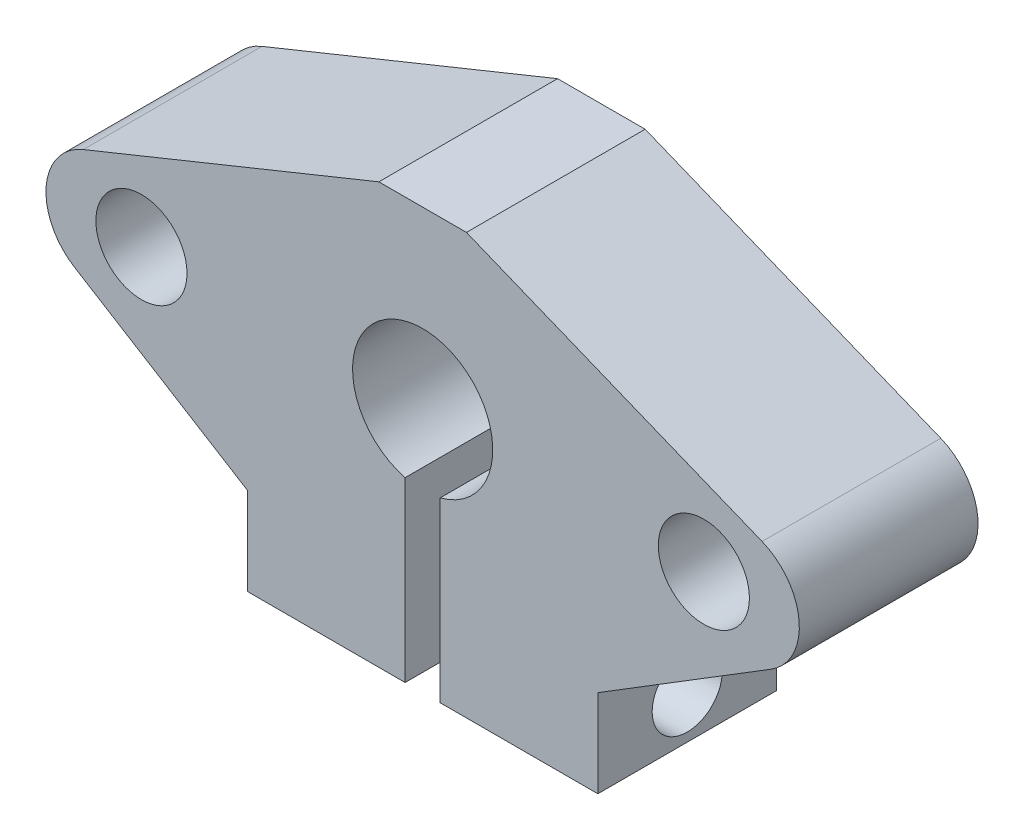
ISO-10303-21;
HEADER;
FILE_DESCRIPTION(('STEP AP214'),'2;1');
FILE_NAME('part.step','',(''),(''),'','','');
FILE_SCHEMA(('AUTOMOTIVE_DESIGN { 1 0 10303 214 1 1 1 1 }'));
ENDSEC;
DATA;
#1=APPLICATION_CONTEXT('core data for automotive mechanical design processes');
#2=APPLICATION_PROTOCOL_DEFINITION('international standard','automotive_design',2000,#1);
#3=PRODUCT_CONTEXT('',#1,'mechanical');
#4=PRODUCT('Part','Part','',(#3));
#5=PRODUCT_RELATED_PRODUCT_CATEGORY('part','',(#4));
#6=PRODUCT_DEFINITION_FORMATION('','',#4);
#7=PRODUCT_DEFINITION_CONTEXT('part definition',#1,'design');
#8=PRODUCT_DEFINITION('design','',#6,#7);
#9=PRODUCT_DEFINITION_SHAPE('','',#8);
#10=(LENGTH_UNIT() NAMED_UNIT(*) SI_UNIT(.MILLI.,.METRE.));
#11=(NAMED_UNIT(*) PLANE_ANGLE_UNIT() SI_UNIT($,.RADIAN.));
#12=(NAMED_UNIT(*) SI_UNIT($,.STERADIAN.) SOLID_ANGLE_UNIT());
#13=UNCERTAINTY_MEASURE_WITH_UNIT(LENGTH_MEASURE(1.E-05),#10,'distance_accuracy_value','');
#14=(GEOMETRIC_REPRESENTATION_CONTEXT(3) GLOBAL_UNCERTAINTY_ASSIGNED_CONTEXT((#13)) GLOBAL_UNIT_ASSIGNED_CONTEXT((#10,
#11,#12)) REPRESENTATION_CONTEXT('',''));
#15=CARTESIAN_POINT('',(0.,0.,0.));
#16=DIRECTION('',(0.,0.,1.));
#17=DIRECTION('',(1.,0.,0.));
#18=AXIS2_PLACEMENT_3D('',#15,#16,#17);
#19=CARTESIAN_POINT('',(-10.0000000000004,1.11022302462516E-13,10.1999999999997));
#20=DIRECTION('',(0.,1.,0.));
#21=DIRECTION('',(-1.,0.,0.));
#22=AXIS2_PLACEMENT_3D('',#19,#20,#21);
#23=PLANE('',#22);
#24=DIRECTION('',(1.,0.,0.));
#25=VECTOR('',#24,1.);
#26=CARTESIAN_POINT('',(-10.0000000000001,0.,0.));
#27=LINE('',#26,#25);
#28=CARTESIAN_POINT('',(-10.0000000000001,0.,0.));
#29=VERTEX_POINT('',#28);
#30=CARTESIAN_POINT('',(-0.999999999999834,0.,0.));
#31=VERTEX_POINT('',#30);
#32=EDGE_CURVE('E160',#29,#31,#27,.T.);
#33=ORIENTED_EDGE('',*,*,#32,.T.);
#34=DIRECTION('',(0.,0.,0.999999999999998));
#35=VECTOR('',#34,1.);
#36=CARTESIAN_POINT('',(-0.999999999999834,0.,0.));
#37=LINE('',#36,#35);
#38=CARTESIAN_POINT('',(-0.999999999999862,1.52655665885959E-13,10.1999999999998));
#39=VERTEX_POINT('',#38);
#40=EDGE_CURVE('E264',#31,#39,#37,.T.);
#41=ORIENTED_EDGE('',*,*,#40,.T.);
#42=DIRECTION('',(1.,0.,0.));
#43=VECTOR('',#42,1.);
#44=CARTESIAN_POINT('',(-10.0000000000004,1.11022302462516E-13,10.1999999999997));
#45=LINE('',#44,#43);
#46=CARTESIAN_POINT('',(-10.0000000000004,1.11022302462516E-13,10.1999999999997));
#47=VERTEX_POINT('',#46);
#48=EDGE_CURVE('E218',#47,#39,#45,.T.);
#49=ORIENTED_EDGE('',*,*,#48,.F.);
#50=DIRECTION('',(0.,0.,-0.999999999999998));
#51=VECTOR('',#50,1.);
#52=CARTESIAN_POINT('',(-10.0000000000004,1.11022302462516E-13,10.1999999999997));
#53=LINE('',#52,#51);
#54=EDGE_CURVE('E11',#47,#29,#53,.T.);
#55=ORIENTED_EDGE('',*,*,#54,.T.);
#56=EDGE_LOOP('',(#33,#41,#49,#55));
#57=FACE_BOUND('',#56,.T.);
#58=ADVANCED_FACE('F36',(#57),#23,.F.);
#59=CARTESIAN_POINT('',(18.0905948060089,14.,10.1999999999997));
#60=DIRECTION('',(0.,0.,0.999999999999998));
#61=DIRECTION('',(1.,0.,0.));
#62=AXIS2_PLACEMENT_3D('',#59,#60,#61);
#63=PLANE('',#62);
#64=DIRECTION('',(0.,-1.,0.));
#65=VECTOR('',#64,1.);
#66=CARTESIAN_POINT('',(-0.999999999999862,1.52655665885959E-13,10.1999999999998));
#67=LINE('',#66,#65);
#68=CARTESIAN_POINT('',(-1.00000000000014,10.1270166537927,10.1999999999998));
#69=VERTEX_POINT('',#68);
#70=EDGE_CURVE('E145',#69,#39,#67,.T.);
#71=ORIENTED_EDGE('',*,*,#70,.F.);
#72=CARTESIAN_POINT('',(0.,14.0000000000002,10.1999999999997));
#73=DIRECTION('',(0.,0.,0.999999999999998));
#74=DIRECTION('',(1.,0.,0.));
#75=AXIS2_PLACEMENT_3D('',#72,#73,#74);
#76=CIRCLE('',#75,4.);
#77=CARTESIAN_POINT('',(0.999999999999862,10.1270166537926,10.1999999999998));
#78=VERTEX_POINT('',#77);
#79=EDGE_CURVE('E165',#78,#69,#76,.T.);
#80=ORIENTED_EDGE('',*,*,#79,.F.);
#81=DIRECTION('',(0.,1.,0.));
#82=VECTOR('',#81,1.);
#83=CARTESIAN_POINT('',(0.999999999999862,0.,10.1999999999998));
#84=LINE('',#83,#82);
#85=CARTESIAN_POINT('',(0.999999999999862,0.,10.1999999999998));
#86=VERTEX_POINT('',#85);
#87=EDGE_CURVE('E60',#86,#78,#84,.T.);
#88=ORIENTED_EDGE('',*,*,#87,.F.);
#89=CARTESIAN_POINT('',(9.99999999999987,0.,10.1999999999997));
#90=VERTEX_POINT('',#89);
#91=EDGE_CURVE('E153',#86,#90,#45,.T.);
#92=ORIENTED_EDGE('',*,*,#91,.T.);
#93=DIRECTION('',(0.,1.,0.));
#94=VECTOR('',#93,1.);
#95=CARTESIAN_POINT('',(9.99999999999987,0.,10.1999999999997));
#96=LINE('',#95,#94);
#97=CARTESIAN_POINT('',(9.9999999999997,5.,10.1999999999997));
#98=VERTEX_POINT('',#97);
#99=EDGE_CURVE('E214',#90,#98,#96,.T.);
#100=ORIENTED_EDGE('',*,*,#99,.T.);
#101=DIRECTION('',(0.850968700396472,0.525216403918943,0.));
#102=VECTOR('',#101,1.);
#103=CARTESIAN_POINT('',(9.9999999999997,5.,10.1999999999997));
#104=LINE('',#103,#102);
#105=CARTESIAN_POINT('',(19.8812703414994,11.0987028929447,10.1999999999997));
#106=VERTEX_POINT('',#105);
#107=EDGE_CURVE('E217',#98,#106,#104,.T.);
#108=ORIENTED_EDGE('',*,*,#107,.T.);
#109=CARTESIAN_POINT('',(18.0905948060089,14.,10.1999999999997));
#110=DIRECTION('',(0.,0.,0.999999999999998));
#111=DIRECTION('',(1.,0.,0.));
#112=AXIS2_PLACEMENT_3D('',#109,#110,#111);
#113=CIRCLE('',#112,3.40940519399083);
#114=CARTESIAN_POINT('',(19.3716162404094,17.1595929898357,10.1999999999997));
#115=VERTEX_POINT('',#114);
#116=EDGE_CURVE('E220',#106,#115,#113,.T.);
#117=ORIENTED_EDGE('',*,*,#116,.T.);
#118=DIRECTION('',(-0.926728508364039,0.375731648634195,0.));
#119=VECTOR('',#118,1.);
#120=CARTESIAN_POINT('',(19.3716162404094,17.1595929898357,10.1999999999997));
#121=LINE('',#120,#119);
#122=CARTESIAN_POINT('',(2.5,24.,10.1999999999998));
#123=VERTEX_POINT('',#122);
#124=EDGE_CURVE('E227',#115,#123,#121,.T.);
#125=ORIENTED_EDGE('',*,*,#124,.T.);
#126=DIRECTION('',(-1.,0.,0.));
#127=VECTOR('',#126,1.);
#128=CARTESIAN_POINT('',(2.5,24.,10.1999999999998));
#129=LINE('',#128,#127);
#130=CARTESIAN_POINT('',(-2.50000000000014,24.,10.1999999999998));
#131=VERTEX_POINT('',#130);
#132=EDGE_CURVE('E229',#123,#131,#129,.T.);
#133=ORIENTED_EDGE('',*,*,#132,.T.);
#134=DIRECTION('',(-0.926728508364038,-0.375731648634195,0.));
#135=VECTOR('',#134,1.);
#136=CARTESIAN_POINT('',(-2.50000000000014,24.,10.1999999999998));
#137=LINE('',#136,#135);
#138=CARTESIAN_POINT('',(-19.3716162404095,17.1595929898357,10.1999999999998));
#139=VERTEX_POINT('',#138);
#140=EDGE_CURVE('E231',#131,#139,#137,.T.);
#141=ORIENTED_EDGE('',*,*,#140,.T.);
#142=CARTESIAN_POINT('',(-18.0905948060093,14.,10.1999999999997));
#143=DIRECTION('',(0.,0.,0.999999999999998));
#144=DIRECTION('',(1.,0.,0.));
#145=AXIS2_PLACEMENT_3D('',#142,#143,#144);
#146=CIRCLE('',#145,3.40940519399084);
#147=CARTESIAN_POINT('',(-19.8812703414997,11.0987028929447,10.1999999999998));
#148=VERTEX_POINT('',#147);
#149=EDGE_CURVE('E233',#139,#148,#146,.T.);
#150=ORIENTED_EDGE('',*,*,#149,.T.);
#151=DIRECTION('',(0.850968700396472,-0.525216403918942,0.));
#152=VECTOR('',#151,1.);
#153=CARTESIAN_POINT('',(-19.8812703414997,11.0987028929447,10.1999999999998));
#154=LINE('',#153,#152);
#155=CARTESIAN_POINT('',(-10.0000000000005,4.99999999999985,10.1999999999997));
#156=VERTEX_POINT('',#155);
#157=EDGE_CURVE('E189',#148,#156,#154,.T.);
#158=ORIENTED_EDGE('',*,*,#157,.T.);
#159=DIRECTION('',(0.,-1.,0.));
#160=VECTOR('',#159,1.);
#161=CARTESIAN_POINT('',(-10.0000000000005,4.99999999999985,10.1999999999997));
#162=LINE('',#161,#160);
#163=EDGE_CURVE('E184',#156,#47,#162,.T.);
#164=ORIENTED_EDGE('',*,*,#163,.T.);
#165=ORIENTED_EDGE('',*,*,#48,.T.);
#166=EDGE_LOOP('',(#71,#80,#88,#92,#100,#108,#117,#125,#133,#141,#150,#158,#164,#165));
#167=FACE_BOUND('',#166,.T.);
#168=CARTESIAN_POINT('',(16.05,14.,10.1999999999997));
#169=DIRECTION('',(0.,0.,0.999999999999998));
#170=DIRECTION('',(1.,0.,0.));
#171=AXIS2_PLACEMENT_3D('',#168,#169,#170);
#172=CIRCLE('',#171,2.6);
#173=CARTESIAN_POINT('',(18.65,14.,10.1999999999997));
#174=VERTEX_POINT('',#173);
#175=EDGE_CURVE('E252',#174,#174,#172,.T.);
#176=ORIENTED_EDGE('',*,*,#175,.F.);
#177=EDGE_LOOP('',(#176));
#178=FACE_BOUND('',#177,.T.);
#179=CARTESIAN_POINT('',(-16.0500000000003,14.,10.1999999999997));
#180=DIRECTION('',(0.,0.,0.999999999999998));
#181=DIRECTION('',(1.,0.,0.));
#182=AXIS2_PLACEMENT_3D('',#179,#180,#181);
#183=CIRCLE('',#182,2.6);
#184=CARTESIAN_POINT('',(-13.4500000000003,14.,10.1999999999997));
#185=VERTEX_POINT('',#184);
#186=EDGE_CURVE('E258',#185,#185,#183,.T.);
#187=ORIENTED_EDGE('',*,*,#186,.F.);
#188=EDGE_LOOP('',(#187));
#189=FACE_BOUND('',#188,.T.);
#190=ADVANCED_FACE('F238',(#167,#178,#189),#63,.T.);
#191=CARTESIAN_POINT('',(18.090594806009,14.,-3.05311331771918E-13));
#192=DIRECTION('',(0.,0.,0.999999999999998));
#193=DIRECTION('',(1.,0.,0.));
#194=AXIS2_PLACEMENT_3D('',#191,#192,#193);
#195=PLANE('',#194);
#196=CARTESIAN_POINT('',(0.,14.0000000000002,0.));
#197=DIRECTION('',(0.,0.,0.999999999999998));
#198=DIRECTION('',(1.,0.,0.));
#199=AXIS2_PLACEMENT_3D('',#196,#197,#198);
#200=CIRCLE('',#199,4.);
#201=CARTESIAN_POINT('',(1.00000000000017,10.1270166537926,0.));
#202=VERTEX_POINT('',#201);
#203=CARTESIAN_POINT('',(-0.999999999999834,10.1270166537927,0.));
#204=VERTEX_POINT('',#203);
#205=EDGE_CURVE('E250',#202,#204,#200,.T.);
#206=ORIENTED_EDGE('',*,*,#205,.T.);
#207=DIRECTION('',(0.,-1.,0.));
#208=VECTOR('',#207,1.);
#209=CARTESIAN_POINT('',(-0.999999999999834,0.,0.));
#210=LINE('',#209,#208);
#211=EDGE_CURVE('E52',#204,#31,#210,.T.);
#212=ORIENTED_EDGE('',*,*,#211,.T.);
#213=ORIENTED_EDGE('',*,*,#32,.F.);
#214=DIRECTION('',(0.,-1.,0.));
#215=VECTOR('',#214,1.);
#216=CARTESIAN_POINT('',(-10.0000000000001,4.99999999999999,0.));
#217=LINE('',#216,#215);
#218=CARTESIAN_POINT('',(-10.0000000000001,4.99999999999999,0.));
#219=VERTEX_POINT('',#218);
#220=EDGE_CURVE('E161',#219,#29,#217,.T.);
#221=ORIENTED_EDGE('',*,*,#220,.F.);
#222=DIRECTION('',(0.850968700396472,-0.525216403918942,0.));
#223=VECTOR('',#222,1.);
#224=CARTESIAN_POINT('',(-19.8812703414994,11.0987028929446,-3.05311331771918E-13));
#225=LINE('',#224,#223);
#226=CARTESIAN_POINT('',(-19.8812703414994,11.0987028929446,-3.05311331771918E-13));
#227=VERTEX_POINT('',#226);
#228=EDGE_CURVE('E182',#227,#219,#225,.T.);
#229=ORIENTED_EDGE('',*,*,#228,.F.);
#230=CARTESIAN_POINT('',(-18.090594806009,14.,-3.05311331771918E-13));
#231=DIRECTION('',(0.,0.,0.999999999999998));
#232=DIRECTION('',(1.,0.,0.));
#233=AXIS2_PLACEMENT_3D('',#230,#231,#232);
#234=CIRCLE('',#233,3.40940519399084);
#235=CARTESIAN_POINT('',(-19.3716162404093,17.1595929898356,-3.05311331771918E-13));
#236=VERTEX_POINT('',#235);
#237=EDGE_CURVE('E180',#236,#227,#234,.T.);
#238=ORIENTED_EDGE('',*,*,#237,.F.);
#239=DIRECTION('',(-0.926728508364038,-0.375731648634195,0.));
#240=VECTOR('',#239,1.);
#241=CARTESIAN_POINT('',(-2.49999999999984,24.,0.));
#242=LINE('',#241,#240);
#243=CARTESIAN_POINT('',(-2.49999999999984,24.,0.));
#244=VERTEX_POINT('',#243);
#245=EDGE_CURVE('E178',#244,#236,#242,.T.);
#246=ORIENTED_EDGE('',*,*,#245,.F.);
#247=DIRECTION('',(-1.,0.,0.));
#248=VECTOR('',#247,1.);
#249=CARTESIAN_POINT('',(2.50000000000028,24.,0.));
#250=LINE('',#249,#248);
#251=CARTESIAN_POINT('',(2.50000000000028,24.,0.));
#252=VERTEX_POINT('',#251);
#253=EDGE_CURVE('E176',#252,#244,#250,.T.);
#254=ORIENTED_EDGE('',*,*,#253,.F.);
#255=DIRECTION('',(-0.926728508364039,0.375731648634195,0.));
#256=VECTOR('',#255,1.);
#257=CARTESIAN_POINT('',(19.3716162404095,17.1595929898359,0.));
#258=LINE('',#257,#256);
#259=CARTESIAN_POINT('',(19.3716162404095,17.1595929898359,0.));
#260=VERTEX_POINT('',#259);
#261=EDGE_CURVE('E174',#260,#252,#258,.T.);
#262=ORIENTED_EDGE('',*,*,#261,.F.);
#263=CARTESIAN_POINT('',(18.090594806009,14.,-3.05311331771918E-13));
#264=DIRECTION('',(0.,0.,0.999999999999998));
#265=DIRECTION('',(1.,0.,0.));
#266=AXIS2_PLACEMENT_3D('',#263,#264,#265);
#267=CIRCLE('',#266,3.40940519399083);
#268=CARTESIAN_POINT('',(19.8812703414998,11.0987028929446,-3.05311331771918E-13));
#269=VERTEX_POINT('',#268);
#270=EDGE_CURVE('E172',#269,#260,#267,.T.);
#271=ORIENTED_EDGE('',*,*,#270,.F.);
#272=DIRECTION('',(0.850968700396472,0.525216403918943,0.));
#273=VECTOR('',#272,1.);
#274=CARTESIAN_POINT('',(10.,5.,0.));
#275=LINE('',#274,#273);
#276=CARTESIAN_POINT('',(10.,5.,0.));
#277=VERTEX_POINT('',#276);
#278=EDGE_CURVE('E170',#277,#269,#275,.T.);
#279=ORIENTED_EDGE('',*,*,#278,.F.);
#280=DIRECTION('',(0.,1.,0.));
#281=VECTOR('',#280,1.);
#282=CARTESIAN_POINT('',(10.0000000000001,-1.52655665885959E-13,0.));
#283=LINE('',#282,#281);
#284=CARTESIAN_POINT('',(10.0000000000001,-1.52655665885959E-13,0.));
#285=VERTEX_POINT('',#284);
#286=EDGE_CURVE('E159',#285,#277,#283,.T.);
#287=ORIENTED_EDGE('',*,*,#286,.F.);
#288=CARTESIAN_POINT('',(1.00000000000017,-1.52655665885959E-13,0.));
#289=VERTEX_POINT('',#288);
#290=EDGE_CURVE('E151',#289,#285,#27,.T.);
#291=ORIENTED_EDGE('',*,*,#290,.F.);
#292=DIRECTION('',(0.,1.,0.));
#293=VECTOR('',#292,1.);
#294=CARTESIAN_POINT('',(1.00000000000017,-1.52655665885959E-13,0.));
#295=LINE('',#294,#293);
#296=EDGE_CURVE('E136',#289,#202,#295,.T.);
#297=ORIENTED_EDGE('',*,*,#296,.T.);
#298=EDGE_LOOP('',(#206,#212,#213,#221,#229,#238,#246,#254,#262,#271,#279,#287,#291,#297));
#299=FACE_BOUND('',#298,.T.);
#300=CARTESIAN_POINT('',(16.05,14.,0.));
#301=DIRECTION('',(0.,0.,0.999999999999998));
#302=DIRECTION('',(1.,0.,0.));
#303=AXIS2_PLACEMENT_3D('',#300,#301,#302);
#304=CIRCLE('',#303,2.6);
#305=CARTESIAN_POINT('',(18.65,14.,0.));
#306=VERTEX_POINT('',#305);
#307=EDGE_CURVE('E255',#306,#306,#304,.T.);
#308=ORIENTED_EDGE('',*,*,#307,.T.);
#309=EDGE_LOOP('',(#308));
#310=FACE_BOUND('',#309,.T.);
#311=CARTESIAN_POINT('',(-16.05,14.,0.));
#312=DIRECTION('',(0.,0.,0.999999999999998));
#313=DIRECTION('',(1.,0.,0.));
#314=AXIS2_PLACEMENT_3D('',#311,#312,#313);
#315=CIRCLE('',#314,2.6);
#316=CARTESIAN_POINT('',(-13.45,14.,0.));
#317=VERTEX_POINT('',#316);
#318=EDGE_CURVE('E261',#317,#317,#315,.T.);
#319=ORIENTED_EDGE('',*,*,#318,.T.);
#320=EDGE_LOOP('',(#319));
#321=FACE_BOUND('',#320,.T.);
#322=ADVANCED_FACE('F156',(#299,#310,#321),#195,.F.);
#323=CARTESIAN_POINT('',(-10.0000000000005,4.99999999999985,10.1999999999997));
#324=DIRECTION('',(1.,0.,0.));
#325=DIRECTION('',(0.,1.,0.));
#326=AXIS2_PLACEMENT_3D('',#323,#324,#325);
#327=PLANE('',#326);
#328=CARTESIAN_POINT('',(-10.0000000000005,2.50000000000007,5.10000000000002));
#329=DIRECTION('',(1.,0.,0.));
#330=DIRECTION('',(0.,1.,0.));
#331=AXIS2_PLACEMENT_3D('',#328,#329,#330);
#332=CIRCLE('',#331,2.);
#333=CARTESIAN_POINT('',(-10.0000000000005,4.50000000000008,5.10000000000002));
#334=VERTEX_POINT('',#333);
#335=EDGE_CURVE('E274',#334,#334,#332,.T.);
#336=ORIENTED_EDGE('',*,*,#335,.T.);
#337=EDGE_LOOP('',(#336));
#338=FACE_BOUND('',#337,.T.);
#339=ORIENTED_EDGE('',*,*,#220,.T.);
#340=ORIENTED_EDGE('',*,*,#54,.F.);
#341=ORIENTED_EDGE('',*,*,#163,.F.);
#342=DIRECTION('',(0.,0.,-0.999999999999998));
#343=VECTOR('',#342,1.);
#344=CARTESIAN_POINT('',(-10.0000000000005,4.99999999999985,10.1999999999997));
#345=LINE('',#344,#343);
#346=EDGE_CURVE('E185',#156,#219,#345,.T.);
#347=ORIENTED_EDGE('',*,*,#346,.T.);
#348=EDGE_LOOP('',(#339,#340,#341,#347));
#349=FACE_BOUND('',#348,.T.);
#350=ADVANCED_FACE('F38',(#338,#349),#327,.F.);
#351=ORIENTED_EDGE('',*,*,#91,.F.);
#352=DIRECTION('',(0.,0.,0.999999999999998));
#353=VECTOR('',#352,1.);
#354=CARTESIAN_POINT('',(1.00000000000017,-1.52655665885959E-13,0.));
#355=LINE('',#354,#353);
#356=EDGE_CURVE('E139',#289,#86,#355,.T.);
#357=ORIENTED_EDGE('',*,*,#356,.F.);
#358=ORIENTED_EDGE('',*,*,#290,.T.);
#359=DIRECTION('',(0.,0.,-0.999999999999998));
#360=VECTOR('',#359,1.);
#361=CARTESIAN_POINT('',(9.99999999999987,0.,10.1999999999997));
#362=LINE('',#361,#360);
#363=EDGE_CURVE('E45',#90,#285,#362,.T.);
#364=ORIENTED_EDGE('',*,*,#363,.F.);
#365=EDGE_LOOP('',(#351,#357,#358,#364));
#366=FACE_BOUND('',#365,.T.);
#367=ADVANCED_FACE('F149',(#366),#23,.F.);
#368=CARTESIAN_POINT('',(9.99999999999987,0.,10.1999999999997));
#369=DIRECTION('',(-1.,0.,0.));
#370=DIRECTION('',(0.,0.,0.999999999999998));
#371=AXIS2_PLACEMENT_3D('',#368,#369,#370);
#372=PLANE('',#371);
#373=CARTESIAN_POINT('',(9.99999999999984,2.5,5.09999999999999));
#374=DIRECTION('',(-1.,0.,0.));
#375=DIRECTION('',(0.,0.,0.999999999999998));
#376=AXIS2_PLACEMENT_3D('',#373,#374,#375);
#377=CIRCLE('',#376,2.);
#378=CARTESIAN_POINT('',(9.99999999999984,2.5,7.09999999999999));
#379=VERTEX_POINT('',#378);
#380=EDGE_CURVE('E278',#379,#379,#377,.T.);
#381=ORIENTED_EDGE('',*,*,#380,.T.);
#382=EDGE_LOOP('',(#381));
#383=FACE_BOUND('',#382,.T.);
#384=ORIENTED_EDGE('',*,*,#286,.T.);
#385=DIRECTION('',(0.,0.,-0.999999999999998));
#386=VECTOR('',#385,1.);
#387=CARTESIAN_POINT('',(9.9999999999997,5.,10.1999999999997));
#388=LINE('',#387,#386);
#389=EDGE_CURVE('E207',#98,#277,#388,.T.);
#390=ORIENTED_EDGE('',*,*,#389,.F.);
#391=ORIENTED_EDGE('',*,*,#99,.F.);
#392=ORIENTED_EDGE('',*,*,#363,.T.);
#393=EDGE_LOOP('',(#384,#390,#391,#392));
#394=FACE_BOUND('',#393,.T.);
#395=ADVANCED_FACE('F212',(#383,#394),#372,.F.);
#396=CARTESIAN_POINT('',(9.9999999999997,5.,10.1999999999997));
#397=DIRECTION('',(-0.525216403918943,0.850968700396472,0.));
#398=DIRECTION('',(-0.850968700396472,-0.525216403918943,0.));
#399=AXIS2_PLACEMENT_3D('',#396,#397,#398);
#400=PLANE('',#399);
#401=ORIENTED_EDGE('',*,*,#278,.T.);
#402=DIRECTION('',(0.,0.,-0.999999999999998));
#403=VECTOR('',#402,1.);
#404=CARTESIAN_POINT('',(19.8812703414994,11.0987028929447,10.1999999999997));
#405=LINE('',#404,#403);
#406=EDGE_CURVE('E204',#106,#269,#405,.T.);
#407=ORIENTED_EDGE('',*,*,#406,.F.);
#408=ORIENTED_EDGE('',*,*,#107,.F.);
#409=ORIENTED_EDGE('',*,*,#389,.T.);
#410=EDGE_LOOP('',(#401,#407,#408,#409));
#411=FACE_BOUND('',#410,.T.);
#412=ADVANCED_FACE('F312',(#411),#400,.F.);
#413=CARTESIAN_POINT('',(18.0905948060089,14.,10.1999999999997));
#414=DIRECTION('',(0.,0.,-0.999999999999998));
#415=DIRECTION('',(-1.,0.,0.));
#416=AXIS2_PLACEMENT_3D('',#413,#414,#415);
#417=CYLINDRICAL_SURFACE('',#416,3.40940519399083);
#418=ORIENTED_EDGE('',*,*,#270,.T.);
#419=DIRECTION('',(0.,0.,-0.999999999999998));
#420=VECTOR('',#419,1.);
#421=CARTESIAN_POINT('',(19.3716162404094,17.1595929898357,10.1999999999997));
#422=LINE('',#421,#420);
#423=EDGE_CURVE('E201',#115,#260,#422,.T.);
#424=ORIENTED_EDGE('',*,*,#423,.F.);
#425=ORIENTED_EDGE('',*,*,#116,.F.);
#426=ORIENTED_EDGE('',*,*,#406,.T.);
#427=EDGE_LOOP('',(#418,#424,#425,#426));
#428=FACE_BOUND('',#427,.T.);
#429=ADVANCED_FACE('F316',(#428),#417,.T.);
#430=CARTESIAN_POINT('',(19.3716162404094,17.1595929898357,10.1999999999997));
#431=DIRECTION('',(-0.375731648634195,-0.926728508364039,0.));
#432=DIRECTION('',(0.926728508364039,-0.375731648634195,0.));
#433=AXIS2_PLACEMENT_3D('',#430,#431,#432);
#434=PLANE('',#433);
#435=ORIENTED_EDGE('',*,*,#261,.T.);
#436=DIRECTION('',(0.,0.,-0.999999999999998));
#437=VECTOR('',#436,1.);
#438=CARTESIAN_POINT('',(2.5,24.,10.1999999999998));
#439=LINE('',#438,#437);
#440=EDGE_CURVE('E198',#123,#252,#439,.T.);
#441=ORIENTED_EDGE('',*,*,#440,.F.);
#442=ORIENTED_EDGE('',*,*,#124,.F.);
#443=ORIENTED_EDGE('',*,*,#423,.T.);
#444=EDGE_LOOP('',(#435,#441,#442,#443));
#445=FACE_BOUND('',#444,.T.);
#446=ADVANCED_FACE('F320',(#445),#434,.F.);
#447=CARTESIAN_POINT('',(2.5,24.,10.1999999999998));
#448=DIRECTION('',(0.,-1.,0.));
#449=DIRECTION('',(0.,0.,-0.999999999999998));
#450=AXIS2_PLACEMENT_3D('',#447,#448,#449);
#451=PLANE('',#450);
#452=ORIENTED_EDGE('',*,*,#253,.T.);
#453=DIRECTION('',(0.,0.,-0.999999999999998));
#454=VECTOR('',#453,1.);
#455=CARTESIAN_POINT('',(-2.50000000000014,24.,10.1999999999998));
#456=LINE('',#455,#454);
#457=EDGE_CURVE('E195',#131,#244,#456,.T.);
#458=ORIENTED_EDGE('',*,*,#457,.F.);
#459=ORIENTED_EDGE('',*,*,#132,.F.);
#460=ORIENTED_EDGE('',*,*,#440,.T.);
#461=EDGE_LOOP('',(#452,#458,#459,#460));
#462=FACE_BOUND('',#461,.T.);
#463=ADVANCED_FACE('F324',(#462),#451,.F.);
#464=CARTESIAN_POINT('',(-2.50000000000014,24.,10.1999999999998));
#465=DIRECTION('',(0.375731648634195,-0.926728508364038,0.));
#466=DIRECTION('',(0.926728508364038,0.375731648634195,0.));
#467=AXIS2_PLACEMENT_3D('',#464,#465,#466);
#468=PLANE('',#467);
#469=ORIENTED_EDGE('',*,*,#245,.T.);
#470=DIRECTION('',(0.,0.,-0.999999999999998));
#471=VECTOR('',#470,1.);
#472=CARTESIAN_POINT('',(-19.3716162404095,17.1595929898357,10.1999999999998));
#473=LINE('',#472,#471);
#474=EDGE_CURVE('E192',#139,#236,#473,.T.);
#475=ORIENTED_EDGE('',*,*,#474,.F.);
#476=ORIENTED_EDGE('',*,*,#140,.F.);
#477=ORIENTED_EDGE('',*,*,#457,.T.);
#478=EDGE_LOOP('',(#469,#475,#476,#477));
#479=FACE_BOUND('',#478,.T.);
#480=ADVANCED_FACE('F328',(#479),#468,.F.);
#481=CARTESIAN_POINT('',(-18.0905948060093,14.,10.1999999999997));
#482=DIRECTION('',(0.,0.,-0.999999999999998));
#483=DIRECTION('',(-1.,0.,0.));
#484=AXIS2_PLACEMENT_3D('',#481,#482,#483);
#485=CYLINDRICAL_SURFACE('',#484,3.40940519399084);
#486=ORIENTED_EDGE('',*,*,#237,.T.);
#487=DIRECTION('',(0.,0.,-0.999999999999998));
#488=VECTOR('',#487,1.);
#489=CARTESIAN_POINT('',(-19.8812703414997,11.0987028929447,10.1999999999998));
#490=LINE('',#489,#488);
#491=EDGE_CURVE('E188',#148,#227,#490,.T.);
#492=ORIENTED_EDGE('',*,*,#491,.F.);
#493=ORIENTED_EDGE('',*,*,#149,.F.);
#494=ORIENTED_EDGE('',*,*,#474,.T.);
#495=EDGE_LOOP('',(#486,#492,#493,#494));
#496=FACE_BOUND('',#495,.T.);
#497=ADVANCED_FACE('F332',(#496),#485,.T.);
#498=CARTESIAN_POINT('',(-19.8812703414997,11.0987028929447,10.1999999999998));
#499=DIRECTION('',(0.525216403918942,0.850968700396472,0.));
#500=DIRECTION('',(-0.850968700396472,0.525216403918942,0.));
#501=AXIS2_PLACEMENT_3D('',#498,#499,#500);
#502=PLANE('',#501);
#503=ORIENTED_EDGE('',*,*,#228,.T.);
#504=ORIENTED_EDGE('',*,*,#346,.F.);
#505=ORIENTED_EDGE('',*,*,#157,.F.);
#506=ORIENTED_EDGE('',*,*,#491,.T.);
#507=EDGE_LOOP('',(#503,#504,#505,#506));
#508=FACE_BOUND('',#507,.T.);
#509=ADVANCED_FACE('F245',(#508),#502,.F.);
#510=CARTESIAN_POINT('',(0.,14.0000000000002,10.1999999999997));
#511=DIRECTION('',(0.,0.,-0.999999999999998));
#512=DIRECTION('',(-1.,0.,0.));
#513=AXIS2_PLACEMENT_3D('',#510,#511,#512);
#514=CYLINDRICAL_SURFACE('',#513,4.);
#515=DIRECTION('',(0.,0.,0.999999999999998));
#516=VECTOR('',#515,1.);
#517=CARTESIAN_POINT('',(-0.999999999999834,10.1270166537927,0.));
#518=LINE('',#517,#516);
#519=EDGE_CURVE('E268',#204,#69,#518,.T.);
#520=ORIENTED_EDGE('',*,*,#519,.F.);
#521=ORIENTED_EDGE('',*,*,#205,.F.);
#522=DIRECTION('',(0.,0.,0.999999999999998));
#523=VECTOR('',#522,1.);
#524=CARTESIAN_POINT('',(1.00000000000017,10.1270166537926,0.));
#525=LINE('',#524,#523);
#526=EDGE_CURVE('E140',#202,#78,#525,.T.);
#527=ORIENTED_EDGE('',*,*,#526,.T.);
#528=ORIENTED_EDGE('',*,*,#79,.T.);
#529=EDGE_LOOP('',(#520,#521,#527,#528));
#530=FACE_BOUND('',#529,.T.);
#531=ADVANCED_FACE('F338',(#530),#514,.F.);
#532=CARTESIAN_POINT('',(16.05,14.,10.1999999999997));
#533=DIRECTION('',(0.,0.,-0.999999999999998));
#534=DIRECTION('',(-1.,0.,0.));
#535=AXIS2_PLACEMENT_3D('',#532,#533,#534);
#536=CYLINDRICAL_SURFACE('',#535,2.6);
#537=ORIENTED_EDGE('',*,*,#175,.T.);
#538=EDGE_LOOP('',(#537));
#539=FACE_BOUND('',#538,.T.);
#540=ORIENTED_EDGE('',*,*,#307,.F.);
#541=EDGE_LOOP('',(#540));
#542=FACE_BOUND('',#541,.T.);
#543=ADVANCED_FACE('F342',(#539,#542),#536,.F.);
#544=CARTESIAN_POINT('',(-16.0500000000003,14.,10.1999999999997));
#545=DIRECTION('',(0.,0.,-0.999999999999998));
#546=DIRECTION('',(-1.,0.,0.));
#547=AXIS2_PLACEMENT_3D('',#544,#545,#546);
#548=CYLINDRICAL_SURFACE('',#547,2.6);
#549=ORIENTED_EDGE('',*,*,#186,.T.);
#550=EDGE_LOOP('',(#549));
#551=FACE_BOUND('',#550,.T.);
#552=ORIENTED_EDGE('',*,*,#318,.F.);
#553=EDGE_LOOP('',(#552));
#554=FACE_BOUND('',#553,.T.);
#555=ADVANCED_FACE('F346',(#551,#554),#548,.F.);
#556=CARTESIAN_POINT('',(1.00000000000017,-1.52655665885959E-13,0.));
#557=DIRECTION('',(1.,0.,0.));
#558=DIRECTION('',(0.,0.,-0.999999999999998));
#559=AXIS2_PLACEMENT_3D('',#556,#557,#558);
#560=PLANE('',#559);
#561=CARTESIAN_POINT('',(0.999999999999945,2.5,5.09999999999999));
#562=DIRECTION('',(1.,0.,0.));
#563=DIRECTION('',(0.,0.,-0.999999999999998));
#564=AXIS2_PLACEMENT_3D('',#561,#562,#563);
#565=CIRCLE('',#564,2.);
#566=CARTESIAN_POINT('',(0.999999999999945,2.5,3.1));
#567=VERTEX_POINT('',#566);
#568=EDGE_CURVE('E281',#567,#567,#565,.T.);
#569=ORIENTED_EDGE('',*,*,#568,.T.);
#570=EDGE_LOOP('',(#569));
#571=FACE_BOUND('',#570,.T.);
#572=ORIENTED_EDGE('',*,*,#87,.T.);
#573=ORIENTED_EDGE('',*,*,#526,.F.);
#574=ORIENTED_EDGE('',*,*,#296,.F.);
#575=ORIENTED_EDGE('',*,*,#356,.T.);
#576=EDGE_LOOP('',(#572,#573,#574,#575));
#577=FACE_BOUND('',#576,.T.);
#578=ADVANCED_FACE('F138',(#571,#577),#560,.F.);
#579=CARTESIAN_POINT('',(-0.999999999999834,0.,0.));
#580=DIRECTION('',(-1.,0.,0.));
#581=DIRECTION('',(0.,-1.,0.));
#582=AXIS2_PLACEMENT_3D('',#579,#580,#581);
#583=PLANE('',#582);
#584=CARTESIAN_POINT('',(-1.00000000000014,2.50000000000013,5.09999999999999));
#585=DIRECTION('',(-1.,0.,0.));
#586=DIRECTION('',(0.,-1.,0.));
#587=AXIS2_PLACEMENT_3D('',#584,#585,#586);
#588=CIRCLE('',#587,2.);
#589=CARTESIAN_POINT('',(-1.00000000000014,0.500000000000122,5.09999999999999));
#590=VERTEX_POINT('',#589);
#591=EDGE_CURVE('E40',#590,#590,#588,.T.);
#592=ORIENTED_EDGE('',*,*,#591,.T.);
#593=EDGE_LOOP('',(#592));
#594=FACE_BOUND('',#593,.T.);
#595=ORIENTED_EDGE('',*,*,#70,.T.);
#596=ORIENTED_EDGE('',*,*,#40,.F.);
#597=ORIENTED_EDGE('',*,*,#211,.F.);
#598=ORIENTED_EDGE('',*,*,#519,.T.);
#599=EDGE_LOOP('',(#595,#596,#597,#598));
#600=FACE_BOUND('',#599,.T.);
#601=ADVANCED_FACE('F288',(#594,#600),#583,.F.);
#602=CARTESIAN_POINT('',(-21.5000000000004,2.49999999999992,5.09999999999999));
#603=DIRECTION('',(1.,0.,0.));
#604=DIRECTION('',(0.,0.,-0.999999999999998));
#605=AXIS2_PLACEMENT_3D('',#602,#603,#604);
#606=CYLINDRICAL_SURFACE('',#605,2.);
#607=ORIENTED_EDGE('',*,*,#591,.F.);
#608=EDGE_LOOP('',(#607));
#609=FACE_BOUND('',#608,.T.);
#610=ORIENTED_EDGE('',*,*,#335,.F.);
#611=EDGE_LOOP('',(#610));
#612=FACE_BOUND('',#611,.T.);
#613=ADVANCED_FACE('F290',(#609,#612),#606,.F.);
#614=ORIENTED_EDGE('',*,*,#568,.F.);
#615=EDGE_LOOP('',(#614));
#616=FACE_BOUND('',#615,.T.);
#617=ORIENTED_EDGE('',*,*,#380,.F.);
#618=EDGE_LOOP('',(#617));
#619=FACE_BOUND('',#618,.T.);
#620=ADVANCED_FACE('F293',(#616,#619),#606,.F.);
#621=CLOSED_SHELL('',(#58,#190,#322,#350,#367,#395,#412,#429,#446,#463,#480,#497,#509,#531,#543,
#555,#578,#601,#613,#620));
#622=MANIFOLD_SOLID_BREP('B2',#621);
#623=ADVANCED_BREP_SHAPE_REPRESENTATION('',(#18,#622),#14);
#624=SHAPE_DEFINITION_REPRESENTATION(#9,#623);
ENDSEC;
END-ISO-10303-21;
